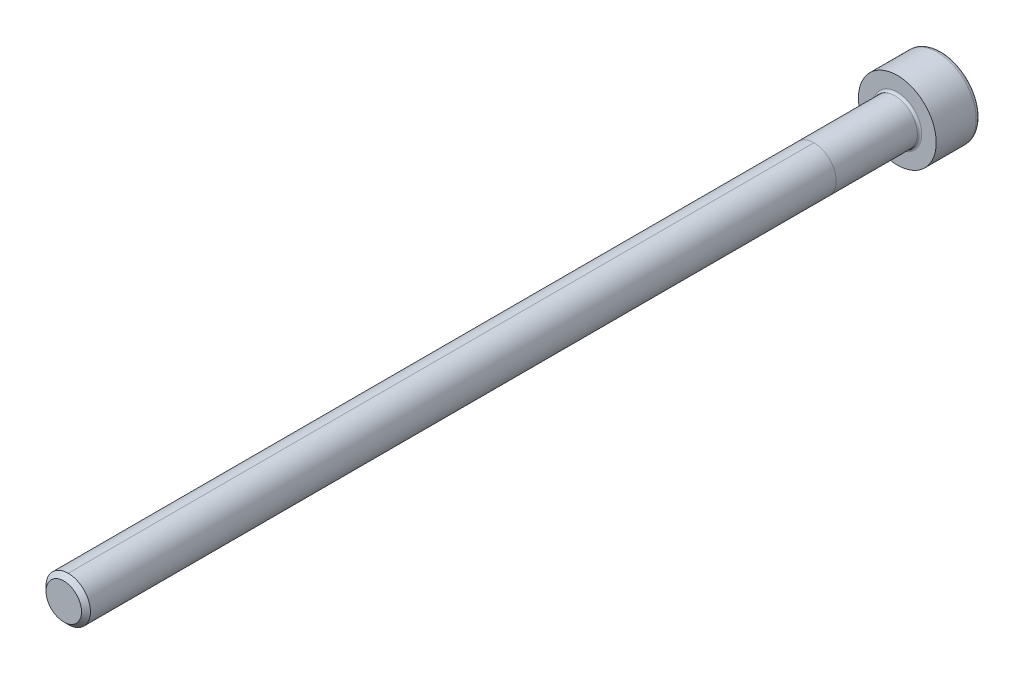
ISO-10303-21;
HEADER;
FILE_DESCRIPTION(('STEP AP214'),'2;1');
FILE_NAME('part.step','',(''),(''),'','','');
FILE_SCHEMA(('AUTOMOTIVE_DESIGN { 1 0 10303 214 1 1 1 1 }'));
ENDSEC;
DATA;
#1=APPLICATION_CONTEXT('core data for automotive mechanical design processes');
#2=APPLICATION_PROTOCOL_DEFINITION('international standard','automotive_design',2000,#1);
#3=PRODUCT_CONTEXT('',#1,'mechanical');
#4=PRODUCT('Part','Part','',(#3));
#5=PRODUCT_RELATED_PRODUCT_CATEGORY('part','',(#4));
#6=PRODUCT_DEFINITION_FORMATION('','',#4);
#7=PRODUCT_DEFINITION_CONTEXT('part definition',#1,'design');
#8=PRODUCT_DEFINITION('design','',#6,#7);
#9=PRODUCT_DEFINITION_SHAPE('','',#8);
#10=(LENGTH_UNIT() NAMED_UNIT(*) SI_UNIT(.MILLI.,.METRE.));
#11=(NAMED_UNIT(*) PLANE_ANGLE_UNIT() SI_UNIT($,.RADIAN.));
#12=(NAMED_UNIT(*) SI_UNIT($,.STERADIAN.) SOLID_ANGLE_UNIT());
#13=UNCERTAINTY_MEASURE_WITH_UNIT(LENGTH_MEASURE(1.E-05),#10,'distance_accuracy_value','');
#14=(GEOMETRIC_REPRESENTATION_CONTEXT(3) GLOBAL_UNCERTAINTY_ASSIGNED_CONTEXT((#13)) GLOBAL_UNIT_ASSIGNED_CONTEXT((#10,
#11,#12)) REPRESENTATION_CONTEXT('',''));
#15=CARTESIAN_POINT('',(0.,0.,0.));
#16=DIRECTION('',(0.,0.,1.));
#17=DIRECTION('',(1.,0.,0.));
#18=AXIS2_PLACEMENT_3D('',#15,#16,#17);
#19=CARTESIAN_POINT('',(0.,0.,75.));
#20=DIRECTION('',(0.,0.,-1.));
#21=DIRECTION('',(-1.,0.,0.));
#22=AXIS2_PLACEMENT_3D('',#19,#20,#21);
#23=CYLINDRICAL_SURFACE('',#22,2.);
#24=DIRECTION('',(0.,0.,-1.));
#25=VECTOR('',#24,1.);
#26=CARTESIAN_POINT('',(0.,2.,75.));
#27=LINE('',#26,#25);
#28=CARTESIAN_POINT('',(0.,2.,74.6));
#29=VERTEX_POINT('',#28);
#30=CARTESIAN_POINT('',(0.,2.,7.49999999999999));
#31=VERTEX_POINT('',#30);
#32=EDGE_CURVE('E62',#29,#31,#27,.T.);
#33=ORIENTED_EDGE('',*,*,#32,.F.);
#34=CARTESIAN_POINT('',(0.,0.,74.6));
#35=DIRECTION('',(0.,0.,1.));
#36=DIRECTION('',(1.,0.,0.));
#37=AXIS2_PLACEMENT_3D('',#34,#35,#36);
#38=CIRCLE('',#37,2.);
#39=CARTESIAN_POINT('',(0.,-2.,74.6));
#40=VERTEX_POINT('',#39);
#41=EDGE_CURVE('E196',#29,#40,#38,.F.);
#42=ORIENTED_EDGE('',*,*,#41,.T.);
#43=DIRECTION('',(0.,0.,-1.));
#44=VECTOR('',#43,1.);
#45=CARTESIAN_POINT('',(0.,-2.00000000000001,75.));
#46=LINE('',#45,#44);
#47=CARTESIAN_POINT('',(0.,-2.00000000000001,7.49999999999999));
#48=VERTEX_POINT('',#47);
#49=EDGE_CURVE('E199',#40,#48,#46,.T.);
#50=ORIENTED_EDGE('',*,*,#49,.T.);
#51=CARTESIAN_POINT('',(0.,0.,7.49999999999999));
#52=DIRECTION('',(0.,0.,1.));
#53=DIRECTION('',(0.,-1.,0.));
#54=AXIS2_PLACEMENT_3D('',#51,#52,#53);
#55=CIRCLE('',#54,2.);
#56=EDGE_CURVE('E68',#48,#31,#55,.T.);
#57=ORIENTED_EDGE('',*,*,#56,.T.);
#58=EDGE_LOOP('',(#33,#42,#50,#57));
#59=FACE_BOUND('',#58,.T.);
#60=ADVANCED_FACE('F47',(#59),#23,.T.);
#61=CARTESIAN_POINT('',(0.,0.,0.200000000000006));
#62=DIRECTION('',(0.,0.,-1.));
#63=DIRECTION('',(-1.,0.,0.));
#64=AXIS2_PLACEMENT_3D('',#61,#62,#63);
#65=CIRCLE('',#64,2.);
#66=CARTESIAN_POINT('',(-2.,0.,0.200000000000006));
#67=VERTEX_POINT('',#66);
#68=EDGE_CURVE('E12',#67,#67,#65,.F.);
#69=ORIENTED_EDGE('',*,*,#68,.T.);
#70=EDGE_LOOP('',(#69));
#71=FACE_BOUND('',#70,.T.);
#72=ORIENTED_EDGE('',*,*,#56,.F.);
#73=EDGE_CURVE('E221',#31,#48,#55,.T.);
#74=ORIENTED_EDGE('',*,*,#73,.F.);
#75=EDGE_LOOP('',(#72,#74));
#76=FACE_BOUND('',#75,.T.);
#77=ADVANCED_FACE('F239',(#71,#76),#23,.T.);
#78=EDGE_CURVE('E197',#40,#29,#38,.F.);
#79=ORIENTED_EDGE('',*,*,#78,.T.);
#80=ORIENTED_EDGE('',*,*,#32,.T.);
#81=ORIENTED_EDGE('',*,*,#73,.T.);
#82=ORIENTED_EDGE('',*,*,#49,.F.);
#83=EDGE_LOOP('',(#79,#80,#81,#82));
#84=FACE_BOUND('',#83,.T.);
#85=ADVANCED_FACE('F242',(#84),#23,.T.);
#86=CARTESIAN_POINT('',(0.,0.,75.));
#87=DIRECTION('',(0.,0.,1.));
#88=DIRECTION('',(1.,0.,0.));
#89=AXIS2_PLACEMENT_3D('',#86,#87,#88);
#90=PLANE('',#89);
#91=CARTESIAN_POINT('',(0.,0.,75.));
#92=DIRECTION('',(0.,0.,1.));
#93=DIRECTION('',(1.,0.,0.));
#94=AXIS2_PLACEMENT_3D('',#91,#92,#93);
#95=CIRCLE('',#94,1.59999999999999);
#96=CARTESIAN_POINT('',(1.59999999999999,0.,75.));
#97=VERTEX_POINT('',#96);
#98=EDGE_CURVE('E193',#97,#97,#95,.T.);
#99=ORIENTED_EDGE('',*,*,#98,.T.);
#100=EDGE_LOOP('',(#99));
#101=FACE_BOUND('',#100,.T.);
#102=ADVANCED_FACE('F250',(#101),#90,.T.);
#103=CARTESIAN_POINT('',(0.,0.,0.));
#104=DIRECTION('',(0.,0.,-1.));
#105=DIRECTION('',(-1.,0.,0.));
#106=AXIS2_PLACEMENT_3D('',#103,#104,#105);
#107=PLANE('',#106);
#108=CARTESIAN_POINT('',(0.,0.,0.));
#109=DIRECTION('',(0.,0.,-1.));
#110=DIRECTION('',(-1.,0.,0.));
#111=AXIS2_PLACEMENT_3D('',#108,#109,#110);
#112=CIRCLE('',#111,2.2);
#113=CARTESIAN_POINT('',(-2.2,0.,0.));
#114=VERTEX_POINT('',#113);
#115=EDGE_CURVE('E55',#114,#114,#112,.T.);
#116=ORIENTED_EDGE('',*,*,#115,.T.);
#117=EDGE_LOOP('',(#116));
#118=FACE_BOUND('',#117,.T.);
#119=CARTESIAN_POINT('',(0.,0.,0.));
#120=DIRECTION('',(0.,0.,-1.));
#121=DIRECTION('',(-1.,0.,0.));
#122=AXIS2_PLACEMENT_3D('',#119,#120,#121);
#123=CIRCLE('',#122,3.5);
#124=CARTESIAN_POINT('',(-3.5,0.,0.));
#125=VERTEX_POINT('',#124);
#126=EDGE_CURVE('E183',#125,#125,#123,.T.);
#127=ORIENTED_EDGE('',*,*,#126,.F.);
#128=EDGE_LOOP('',(#127));
#129=FACE_BOUND('',#128,.T.);
#130=ADVANCED_FACE('F228',(#118,#129),#107,.F.);
#131=CARTESIAN_POINT('',(0.,0.,-4.));
#132=DIRECTION('',(0.,0.,1.));
#133=DIRECTION('',(1.,0.,0.));
#134=AXIS2_PLACEMENT_3D('',#131,#132,#133);
#135=CYLINDRICAL_SURFACE('',#134,3.5);
#136=CARTESIAN_POINT('',(0.,0.,-3.6));
#137=DIRECTION('',(0.,0.,-1.));
#138=DIRECTION('',(-1.,0.,0.));
#139=AXIS2_PLACEMENT_3D('',#136,#137,#138);
#140=CIRCLE('',#139,3.5);
#141=CARTESIAN_POINT('',(-3.5,0.,-3.6));
#142=VERTEX_POINT('',#141);
#143=EDGE_CURVE('E190',#142,#142,#140,.F.);
#144=ORIENTED_EDGE('',*,*,#143,.T.);
#145=EDGE_LOOP('',(#144));
#146=FACE_BOUND('',#145,.T.);
#147=ORIENTED_EDGE('',*,*,#126,.T.);
#148=EDGE_LOOP('',(#147));
#149=FACE_BOUND('',#148,.T.);
#150=ADVANCED_FACE('F286',(#146,#149),#135,.T.);
#151=CARTESIAN_POINT('',(0.,0.,-4.));
#152=DIRECTION('',(0.,0.,-1.));
#153=DIRECTION('',(-1.,0.,0.));
#154=AXIS2_PLACEMENT_3D('',#151,#152,#153);
#155=PLANE('',#154);
#156=DIRECTION('',(0.499999999999998,-0.866025403784439,0.));
#157=VECTOR('',#156,1.);
#158=CARTESIAN_POINT('',(0.866025403784439,1.5,-4.));
#159=LINE('',#158,#157);
#160=CARTESIAN_POINT('',(0.866025403784439,1.5,-4.));
#161=VERTEX_POINT('',#160);
#162=CARTESIAN_POINT('',(1.73205080756888,0.,-4.));
#163=VERTEX_POINT('',#162);
#164=EDGE_CURVE('E126',#161,#163,#159,.T.);
#165=ORIENTED_EDGE('',*,*,#164,.F.);
#166=DIRECTION('',(1.,0.,0.));
#167=VECTOR('',#166,1.);
#168=CARTESIAN_POINT('',(-0.866025403784446,1.5,-4.));
#169=LINE('',#168,#167);
#170=CARTESIAN_POINT('',(-0.866025403784446,1.5,-4.));
#171=VERTEX_POINT('',#170);
#172=EDGE_CURVE('E180',#171,#161,#169,.T.);
#173=ORIENTED_EDGE('',*,*,#172,.F.);
#174=DIRECTION('',(0.5,0.866025403784439,0.));
#175=VECTOR('',#174,1.);
#176=CARTESIAN_POINT('',(-1.73205080756888,0.,-4.));
#177=LINE('',#176,#175);
#178=CARTESIAN_POINT('',(-1.73205080756888,0.,-4.));
#179=VERTEX_POINT('',#178);
#180=EDGE_CURVE('E177',#179,#171,#177,.T.);
#181=ORIENTED_EDGE('',*,*,#180,.F.);
#182=DIRECTION('',(-0.5,0.866025403784439,0.));
#183=VECTOR('',#182,1.);
#184=CARTESIAN_POINT('',(-0.866025403784443,-1.5,-4.));
#185=LINE('',#184,#183);
#186=CARTESIAN_POINT('',(-0.866025403784443,-1.5,-4.));
#187=VERTEX_POINT('',#186);
#188=EDGE_CURVE('E174',#187,#179,#185,.T.);
#189=ORIENTED_EDGE('',*,*,#188,.F.);
#190=DIRECTION('',(-1.,0.,0.));
#191=VECTOR('',#190,1.);
#192=CARTESIAN_POINT('',(0.866025403784436,-1.5,-4.));
#193=LINE('',#192,#191);
#194=CARTESIAN_POINT('',(0.866025403784436,-1.5,-4.));
#195=VERTEX_POINT('',#194);
#196=EDGE_CURVE('E171',#195,#187,#193,.T.);
#197=ORIENTED_EDGE('',*,*,#196,.F.);
#198=DIRECTION('',(-0.500000000000001,-0.866025403784438,0.));
#199=VECTOR('',#198,1.);
#200=CARTESIAN_POINT('',(1.73205080756888,0.,-4.));
#201=LINE('',#200,#199);
#202=EDGE_CURVE('E168',#163,#195,#201,.T.);
#203=ORIENTED_EDGE('',*,*,#202,.F.);
#204=EDGE_LOOP('',(#165,#173,#181,#189,#197,#203));
#205=FACE_BOUND('',#204,.T.);
#206=CARTESIAN_POINT('',(0.,0.,-4.));
#207=DIRECTION('',(0.,0.,-1.));
#208=DIRECTION('',(-1.,0.,0.));
#209=AXIS2_PLACEMENT_3D('',#206,#207,#208);
#210=CIRCLE('',#209,3.1);
#211=CARTESIAN_POINT('',(-3.1,0.,-4.));
#212=VERTEX_POINT('',#211);
#213=EDGE_CURVE('E186',#212,#212,#210,.T.);
#214=ORIENTED_EDGE('',*,*,#213,.T.);
#215=EDGE_LOOP('',(#214));
#216=FACE_BOUND('',#215,.T.);
#217=ADVANCED_FACE('F281',(#205,#216),#155,.T.);
#218=CARTESIAN_POINT('',(0.,0.,-3.6));
#219=DIRECTION('',(0.,0.,-1.));
#220=DIRECTION('',(-1.,0.,0.));
#221=AXIS2_PLACEMENT_3D('',#218,#219,#220);
#222=TOROIDAL_SURFACE('',#221,3.1,0.4);
#223=ORIENTED_EDGE('',*,*,#143,.F.);
#224=EDGE_LOOP('',(#223));
#225=FACE_BOUND('',#224,.T.);
#226=ORIENTED_EDGE('',*,*,#213,.F.);
#227=EDGE_LOOP('',(#226));
#228=FACE_BOUND('',#227,.T.);
#229=ADVANCED_FACE('F272',(#225,#228),#222,.T.);
#230=CARTESIAN_POINT('',(0.,0.,75.));
#231=DIRECTION('',(0.,0.,-1.));
#232=DIRECTION('',(-1.,0.,0.));
#233=AXIS2_PLACEMENT_3D('',#230,#231,#232);
#234=CONICAL_SURFACE('',#233,1.59999999999999,0.785398163397466);
#235=ORIENTED_EDGE('',*,*,#78,.F.);
#236=ORIENTED_EDGE('',*,*,#41,.F.);
#237=EDGE_LOOP('',(#235,#236));
#238=FACE_BOUND('',#237,.T.);
#239=ORIENTED_EDGE('',*,*,#98,.F.);
#240=EDGE_LOOP('',(#239));
#241=FACE_BOUND('',#240,.T.);
#242=ADVANCED_FACE('F259',(#238,#241),#234,.T.);
#243=CARTESIAN_POINT('',(0.866025403784439,1.5,-2.66666666666667));
#244=DIRECTION('',(0.866025403784439,0.499999999999998,0.));
#245=DIRECTION('',(-0.499999999999999,0.86602540378444,0.));
#246=AXIS2_PLACEMENT_3D('',#243,#244,#245);
#247=PLANE('',#246);
#248=ORIENTED_EDGE('',*,*,#164,.T.);
#249=DIRECTION('',(0.,0.,-1.));
#250=VECTOR('',#249,1.);
#251=CARTESIAN_POINT('',(1.73205080756888,0.,-2.66666666666667));
#252=LINE('',#251,#250);
#253=CARTESIAN_POINT('',(1.73205080756887,0.,-2.66666666666667));
#254=VERTEX_POINT('',#253);
#255=EDGE_CURVE('E204',#254,#163,#252,.T.);
#256=ORIENTED_EDGE('',*,*,#255,.F.);
#257=DIRECTION('',(-0.499999999999998,0.86602540378444,0.));
#258=VECTOR('',#257,1.);
#259=CARTESIAN_POINT('',(1.73205080756887,0.,-2.66666666666667));
#260=LINE('',#259,#258);
#261=CARTESIAN_POINT('',(0.866025403784439,1.5,-2.66666666666667));
#262=VERTEX_POINT('',#261);
#263=EDGE_CURVE('E121',#262,#254,#260,.F.);
#264=ORIENTED_EDGE('',*,*,#263,.F.);
#265=DIRECTION('',(0.,0.,-1.));
#266=VECTOR('',#265,1.);
#267=CARTESIAN_POINT('',(0.866025403784439,1.5,-2.66666666666667));
#268=LINE('',#267,#266);
#269=EDGE_CURVE('E187',#262,#161,#268,.T.);
#270=ORIENTED_EDGE('',*,*,#269,.T.);
#271=EDGE_LOOP('',(#248,#256,#264,#270));
#272=FACE_BOUND('',#271,.T.);
#273=ADVANCED_FACE('F271',(#272),#247,.F.);
#274=CARTESIAN_POINT('',(-0.866025403784446,1.5,-2.66666666666667));
#275=DIRECTION('',(0.,1.,0.));
#276=DIRECTION('',(0.,0.,1.));
#277=AXIS2_PLACEMENT_3D('',#274,#275,#276);
#278=PLANE('',#277);
#279=ORIENTED_EDGE('',*,*,#172,.T.);
#280=ORIENTED_EDGE('',*,*,#269,.F.);
#281=DIRECTION('',(1.,0.,0.));
#282=VECTOR('',#281,1.);
#283=CARTESIAN_POINT('',(0.,1.5,-2.66666666666667));
#284=LINE('',#283,#282);
#285=CARTESIAN_POINT('',(-0.866025403784447,1.5,-2.66666666666667));
#286=VERTEX_POINT('',#285);
#287=EDGE_CURVE('E135',#286,#262,#284,.T.);
#288=ORIENTED_EDGE('',*,*,#287,.F.);
#289=DIRECTION('',(0.,0.,-1.));
#290=VECTOR('',#289,1.);
#291=CARTESIAN_POINT('',(-0.866025403784446,1.5,-2.66666666666667));
#292=LINE('',#291,#290);
#293=EDGE_CURVE('E200',#286,#171,#292,.T.);
#294=ORIENTED_EDGE('',*,*,#293,.T.);
#295=EDGE_LOOP('',(#279,#280,#288,#294));
#296=FACE_BOUND('',#295,.T.);
#297=ADVANCED_FACE('F278',(#296),#278,.F.);
#298=CARTESIAN_POINT('',(-1.73205080756888,0.,-2.66666666666667));
#299=DIRECTION('',(-0.866025403784439,0.5,0.));
#300=DIRECTION('',(-0.5,-0.866025403784439,0.));
#301=AXIS2_PLACEMENT_3D('',#298,#299,#300);
#302=PLANE('',#301);
#303=ORIENTED_EDGE('',*,*,#180,.T.);
#304=ORIENTED_EDGE('',*,*,#293,.F.);
#305=DIRECTION('',(-0.5,-0.866025403784439,0.));
#306=VECTOR('',#305,1.);
#307=CARTESIAN_POINT('',(-0.866025403784447,1.5,-2.66666666666667));
#308=LINE('',#307,#306);
#309=CARTESIAN_POINT('',(-1.73205080756888,0.,-2.66666666666667));
#310=VERTEX_POINT('',#309);
#311=EDGE_CURVE('E143',#310,#286,#308,.F.);
#312=ORIENTED_EDGE('',*,*,#311,.F.);
#313=DIRECTION('',(0.,0.,-1.));
#314=VECTOR('',#313,1.);
#315=CARTESIAN_POINT('',(-1.73205080756888,0.,-2.66666666666667));
#316=LINE('',#315,#314);
#317=EDGE_CURVE('E202',#310,#179,#316,.T.);
#318=ORIENTED_EDGE('',*,*,#317,.T.);
#319=EDGE_LOOP('',(#303,#304,#312,#318));
#320=FACE_BOUND('',#319,.T.);
#321=ADVANCED_FACE('F314',(#320),#302,.F.);
#322=CARTESIAN_POINT('',(-0.866025403784443,-1.5,-2.66666666666667));
#323=DIRECTION('',(-0.866025403784439,-0.5,0.));
#324=DIRECTION('',(0.5,-0.866025403784439,0.));
#325=AXIS2_PLACEMENT_3D('',#322,#323,#324);
#326=PLANE('',#325);
#327=ORIENTED_EDGE('',*,*,#188,.T.);
#328=ORIENTED_EDGE('',*,*,#317,.F.);
#329=DIRECTION('',(0.5,-0.866025403784439,0.));
#330=VECTOR('',#329,1.);
#331=CARTESIAN_POINT('',(-1.73205080756888,0.,-2.66666666666667));
#332=LINE('',#331,#330);
#333=CARTESIAN_POINT('',(-0.866025403784443,-1.5,-2.66666666666667));
#334=VERTEX_POINT('',#333);
#335=EDGE_CURVE('E151',#334,#310,#332,.F.);
#336=ORIENTED_EDGE('',*,*,#335,.F.);
#337=DIRECTION('',(0.,0.,-1.));
#338=VECTOR('',#337,1.);
#339=CARTESIAN_POINT('',(-0.866025403784443,-1.5,-2.66666666666667));
#340=LINE('',#339,#338);
#341=EDGE_CURVE('E209',#334,#187,#340,.T.);
#342=ORIENTED_EDGE('',*,*,#341,.T.);
#343=EDGE_LOOP('',(#327,#328,#336,#342));
#344=FACE_BOUND('',#343,.T.);
#345=ADVANCED_FACE('F310',(#344),#326,.F.);
#346=CARTESIAN_POINT('',(0.866025403784436,-1.5,-2.66666666666667));
#347=DIRECTION('',(0.,-1.,0.));
#348=DIRECTION('',(0.,0.,-1.));
#349=AXIS2_PLACEMENT_3D('',#346,#347,#348);
#350=PLANE('',#349);
#351=ORIENTED_EDGE('',*,*,#196,.T.);
#352=ORIENTED_EDGE('',*,*,#341,.F.);
#353=DIRECTION('',(1.,0.,0.));
#354=VECTOR('',#353,1.);
#355=CARTESIAN_POINT('',(0.,-1.5,-2.66666666666667));
#356=LINE('',#355,#354);
#357=CARTESIAN_POINT('',(0.866025403784436,-1.5,-2.66666666666667));
#358=VERTEX_POINT('',#357);
#359=EDGE_CURVE('E158',#358,#334,#356,.F.);
#360=ORIENTED_EDGE('',*,*,#359,.F.);
#361=DIRECTION('',(0.,0.,-1.));
#362=VECTOR('',#361,1.);
#363=CARTESIAN_POINT('',(0.866025403784436,-1.5,-2.66666666666667));
#364=LINE('',#363,#362);
#365=EDGE_CURVE('E207',#358,#195,#364,.T.);
#366=ORIENTED_EDGE('',*,*,#365,.T.);
#367=EDGE_LOOP('',(#351,#352,#360,#366));
#368=FACE_BOUND('',#367,.T.);
#369=ADVANCED_FACE('F306',(#368),#350,.F.);
#370=CARTESIAN_POINT('',(1.73205080756888,0.,-2.66666666666667));
#371=DIRECTION('',(0.866025403784438,-0.500000000000001,0.));
#372=DIRECTION('',(0.500000000000001,0.866025403784438,0.));
#373=AXIS2_PLACEMENT_3D('',#370,#371,#372);
#374=PLANE('',#373);
#375=ORIENTED_EDGE('',*,*,#202,.T.);
#376=ORIENTED_EDGE('',*,*,#365,.F.);
#377=DIRECTION('',(0.500000000000001,0.866025403784438,0.));
#378=VECTOR('',#377,1.);
#379=CARTESIAN_POINT('',(0.866025403784436,-1.5,-2.66666666666667));
#380=LINE('',#379,#378);
#381=EDGE_CURVE('E163',#254,#358,#380,.F.);
#382=ORIENTED_EDGE('',*,*,#381,.F.);
#383=ORIENTED_EDGE('',*,*,#255,.T.);
#384=EDGE_LOOP('',(#375,#376,#382,#383));
#385=FACE_BOUND('',#384,.T.);
#386=ADVANCED_FACE('F303',(#385),#374,.F.);
#387=CARTESIAN_POINT('',(-0.583171863311223,-0.336694432266549,-1.89390618149934));
#388=DIRECTION('',(0.290126882702444,0.167504833827402,0.942214690279141));
#389=DIRECTION('',(0.955717783517744,0.,-0.294284757111084));
#390=AXIS2_PLACEMENT_3D('',#387,#388,#389);
#391=PLANE('',#390);
#392=DIRECTION('',(-0.477858891758872,-0.827675879374924,0.294284757111084));
#393=VECTOR('',#392,1.);
#394=CARTESIAN_POINT('',(0.866025403784439,1.5,-2.66666666666667));
#395=LINE('',#394,#393);
#396=CARTESIAN_POINT('',(0.,0.,-2.13333333333333));
#397=VERTEX_POINT('',#396);
#398=EDGE_CURVE('E118',#262,#397,#395,.T.);
#399=ORIENTED_EDGE('',*,*,#398,.F.);
#400=ORIENTED_EDGE('',*,*,#263,.T.);
#401=DIRECTION('',(-0.955717783517745,0.,0.294284757111084));
#402=VECTOR('',#401,1.);
#403=CARTESIAN_POINT('',(1.73205080756888,0.,-2.66666666666667));
#404=LINE('',#403,#402);
#405=EDGE_CURVE('E115',#254,#397,#404,.T.);
#406=ORIENTED_EDGE('',*,*,#405,.T.);
#407=EDGE_LOOP('',(#399,#400,#406));
#408=FACE_BOUND('',#407,.T.);
#409=ADVANCED_FACE('F117',(#408),#391,.F.);
#410=CARTESIAN_POINT('',(-0.583171863311223,0.336694432266551,-1.89390618149934));
#411=DIRECTION('',(0.290126882702444,-0.167504833827403,0.94221469027914));
#412=DIRECTION('',(0.955717783517745,0.,-0.294284757111084));
#413=AXIS2_PLACEMENT_3D('',#410,#411,#412);
#414=PLANE('',#413);
#415=ORIENTED_EDGE('',*,*,#405,.F.);
#416=ORIENTED_EDGE('',*,*,#381,.T.);
#417=DIRECTION('',(-0.477858891758872,0.827675879374924,0.294284757111084));
#418=VECTOR('',#417,1.);
#419=CARTESIAN_POINT('',(0.866025403784436,-1.5,-2.66666666666667));
#420=LINE('',#419,#418);
#421=EDGE_CURVE('E156',#358,#397,#420,.T.);
#422=ORIENTED_EDGE('',*,*,#421,.T.);
#423=EDGE_LOOP('',(#415,#416,#422));
#424=FACE_BOUND('',#423,.T.);
#425=ADVANCED_FACE('F161',(#424),#414,.F.);
#426=CARTESIAN_POINT('',(0.,-0.673388864533099,-1.89390618149934));
#427=DIRECTION('',(0.,0.335009667654805,0.942214690279141));
#428=DIRECTION('',(0.,-0.942214690279141,0.335009667654805));
#429=AXIS2_PLACEMENT_3D('',#426,#427,#428);
#430=PLANE('',#429);
#431=DIRECTION('',(0.477858891758875,-0.827675879374922,0.294284757111083));
#432=VECTOR('',#431,1.);
#433=CARTESIAN_POINT('',(-0.866025403784446,1.5,-2.66666666666667));
#434=LINE('',#433,#432);
#435=EDGE_CURVE('E132',#286,#397,#434,.T.);
#436=ORIENTED_EDGE('',*,*,#435,.F.);
#437=ORIENTED_EDGE('',*,*,#287,.T.);
#438=ORIENTED_EDGE('',*,*,#398,.T.);
#439=EDGE_LOOP('',(#436,#437,#438));
#440=FACE_BOUND('',#439,.T.);
#441=ADVANCED_FACE('F131',(#440),#430,.F.);
#442=CARTESIAN_POINT('',(0.58317186331122,-0.336694432266548,-1.89390618149934));
#443=DIRECTION('',(-0.290126882702442,0.167504833827402,0.942214690279141));
#444=DIRECTION('',(0.955717783517745,0.,0.294284757111083));
#445=AXIS2_PLACEMENT_3D('',#442,#443,#444);
#446=PLANE('',#445);
#447=DIRECTION('',(0.955717783517745,0.,0.294284757111083));
#448=VECTOR('',#447,1.);
#449=CARTESIAN_POINT('',(-1.73205080756888,0.,-2.66666666666667));
#450=LINE('',#449,#448);
#451=EDGE_CURVE('E140',#310,#397,#450,.T.);
#452=ORIENTED_EDGE('',*,*,#451,.F.);
#453=ORIENTED_EDGE('',*,*,#311,.T.);
#454=ORIENTED_EDGE('',*,*,#435,.T.);
#455=EDGE_LOOP('',(#452,#453,#454));
#456=FACE_BOUND('',#455,.T.);
#457=ADVANCED_FACE('F139',(#456),#446,.F.);
#458=CARTESIAN_POINT('',(0.583171863311222,0.336694432266549,-1.89390618149934));
#459=DIRECTION('',(-0.290126882702443,-0.167504833827402,0.942214690279141));
#460=DIRECTION('',(0.955717783517745,0.,0.294284757111083));
#461=AXIS2_PLACEMENT_3D('',#458,#459,#460);
#462=PLANE('',#461);
#463=DIRECTION('',(0.477858891758875,0.827675879374922,0.294284757111084));
#464=VECTOR('',#463,1.);
#465=CARTESIAN_POINT('',(-0.866025403784443,-1.5,-2.66666666666667));
#466=LINE('',#465,#464);
#467=EDGE_CURVE('E148',#334,#397,#466,.T.);
#468=ORIENTED_EDGE('',*,*,#467,.F.);
#469=ORIENTED_EDGE('',*,*,#335,.T.);
#470=ORIENTED_EDGE('',*,*,#451,.T.);
#471=EDGE_LOOP('',(#468,#469,#470));
#472=FACE_BOUND('',#471,.T.);
#473=ADVANCED_FACE('F147',(#472),#462,.F.);
#474=CARTESIAN_POINT('',(0.,0.6733888645331,-1.89390618149934));
#475=DIRECTION('',(0.,-0.335009667654806,0.94221469027914));
#476=DIRECTION('',(0.,-0.94221469027914,-0.335009667654806));
#477=AXIS2_PLACEMENT_3D('',#474,#475,#476);
#478=PLANE('',#477);
#479=ORIENTED_EDGE('',*,*,#421,.F.);
#480=ORIENTED_EDGE('',*,*,#359,.T.);
#481=ORIENTED_EDGE('',*,*,#467,.T.);
#482=EDGE_LOOP('',(#479,#480,#481));
#483=FACE_BOUND('',#482,.T.);
#484=ADVANCED_FACE('F155',(#483),#478,.F.);
#485=CARTESIAN_POINT('',(0.,0.,0.200000000000006));
#486=DIRECTION('',(0.,0.,-1.));
#487=DIRECTION('',(-1.,0.,0.));
#488=AXIS2_PLACEMENT_3D('',#485,#486,#487);
#489=TOROIDAL_SURFACE('',#488,2.2,0.2);
#490=ORIENTED_EDGE('',*,*,#68,.F.);
#491=EDGE_LOOP('',(#490));
#492=FACE_BOUND('',#491,.T.);
#493=ORIENTED_EDGE('',*,*,#115,.F.);
#494=EDGE_LOOP('',(#493));
#495=FACE_BOUND('',#494,.T.);
#496=ADVANCED_FACE('F49',(#492,#495),#489,.F.);
#497=CLOSED_SHELL('',(#60,#77,#85,#102,#130,#150,#217,#229,#242,#273,#297,#321,#345,#369,#386,
#409,#425,#441,#457,#473,#484,#496));
#498=MANIFOLD_SOLID_BREP('B2',#497);
#499=ADVANCED_BREP_SHAPE_REPRESENTATION('',(#18,#498),#14);
#500=SHAPE_DEFINITION_REPRESENTATION(#9,#499);
ENDSEC;
END-ISO-10303-21;
